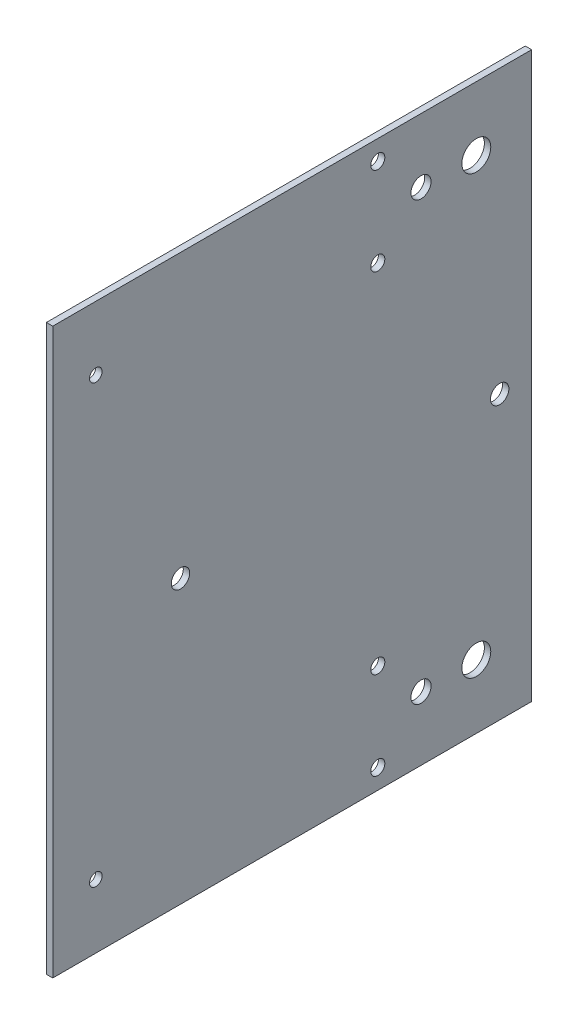
ISO-10303-21;
HEADER;
FILE_DESCRIPTION(('STEP AP214'),'2;1');
FILE_NAME('part.step','',(''),(''),'','','');
FILE_SCHEMA(('AUTOMOTIVE_DESIGN { 1 0 10303 214 1 1 1 1 }'));
ENDSEC;
DATA;
#1=APPLICATION_CONTEXT('core data for automotive mechanical design processes');
#2=APPLICATION_PROTOCOL_DEFINITION('international standard','automotive_design',2000,#1);
#3=PRODUCT_CONTEXT('',#1,'mechanical');
#4=PRODUCT('Part','Part','',(#3));
#5=PRODUCT_RELATED_PRODUCT_CATEGORY('part','',(#4));
#6=PRODUCT_DEFINITION_FORMATION('','',#4);
#7=PRODUCT_DEFINITION_CONTEXT('part definition',#1,'design');
#8=PRODUCT_DEFINITION('design','',#6,#7);
#9=PRODUCT_DEFINITION_SHAPE('','',#8);
#10=(LENGTH_UNIT() NAMED_UNIT(*) SI_UNIT(.MILLI.,.METRE.));
#11=(NAMED_UNIT(*) PLANE_ANGLE_UNIT() SI_UNIT($,.RADIAN.));
#12=(NAMED_UNIT(*) SI_UNIT($,.STERADIAN.) SOLID_ANGLE_UNIT());
#13=UNCERTAINTY_MEASURE_WITH_UNIT(LENGTH_MEASURE(1.E-05),#10,'distance_accuracy_value','');
#14=(GEOMETRIC_REPRESENTATION_CONTEXT(3) GLOBAL_UNCERTAINTY_ASSIGNED_CONTEXT((#13)) GLOBAL_UNIT_ASSIGNED_CONTEXT((#10,
#11,#12)) REPRESENTATION_CONTEXT('',''));
#15=CARTESIAN_POINT('',(0.,0.,0.));
#16=DIRECTION('',(0.,0.,1.));
#17=DIRECTION('',(1.,0.,0.));
#18=AXIS2_PLACEMENT_3D('',#15,#16,#17);
#19=CARTESIAN_POINT('',(0.,83.4547340050886,-95.25));
#20=DIRECTION('',(0.,0.,1.));
#21=DIRECTION('',(0.,-1.,0.));
#22=AXIS2_PLACEMENT_3D('',#19,#20,#21);
#23=PLANE('',#22);
#24=DIRECTION('',(0.,-1.,0.));
#25=VECTOR('',#24,1.);
#26=CARTESIAN_POINT('',(0.,83.4547340050886,-95.25));
#27=LINE('',#26,#25);
#28=CARTESIAN_POINT('',(0.,112.299468010177,-95.25));
#29=VERTEX_POINT('',#28);
#30=CARTESIAN_POINT('',(0.,0.,-95.25));
#31=VERTEX_POINT('',#30);
#32=EDGE_CURVE('E12',#29,#31,#27,.T.);
#33=ORIENTED_EDGE('',*,*,#32,.F.);
#34=DIRECTION('',(-1.,0.,0.));
#35=VECTOR('',#34,1.);
#36=CARTESIAN_POINT('',(0.,112.299468010177,-95.25));
#37=LINE('',#36,#35);
#38=CARTESIAN_POINT('',(1.27,112.299468010177,-95.25));
#39=VERTEX_POINT('',#38);
#40=EDGE_CURVE('E87',#39,#29,#37,.T.);
#41=ORIENTED_EDGE('',*,*,#40,.F.);
#42=DIRECTION('',(0.,1.,0.));
#43=VECTOR('',#42,1.);
#44=CARTESIAN_POINT('',(1.27,83.4547340050886,-95.25));
#45=LINE('',#44,#43);
#46=CARTESIAN_POINT('',(1.27,0.,-95.25));
#47=VERTEX_POINT('',#46);
#48=EDGE_CURVE('E58',#39,#47,#45,.F.);
#49=ORIENTED_EDGE('',*,*,#48,.T.);
#50=DIRECTION('',(-1.,0.,0.));
#51=VECTOR('',#50,1.);
#52=CARTESIAN_POINT('',(0.,0.,-95.25));
#53=LINE('',#52,#51);
#54=EDGE_CURVE('E85',#47,#31,#53,.T.);
#55=ORIENTED_EDGE('',*,*,#54,.T.);
#56=EDGE_LOOP('',(#33,#41,#49,#55));
#57=FACE_BOUND('',#56,.T.);
#58=ADVANCED_FACE('F39',(#57),#23,.F.);
#59=CARTESIAN_POINT('',(0.,83.4547340050886,0.));
#60=DIRECTION('',(0.,0.,1.));
#61=DIRECTION('',(0.,-1.,0.));
#62=AXIS2_PLACEMENT_3D('',#59,#60,#61);
#63=PLANE('',#62);
#64=DIRECTION('',(0.,-1.,0.));
#65=VECTOR('',#64,1.);
#66=CARTESIAN_POINT('',(0.,83.4547340050886,0.));
#67=LINE('',#66,#65);
#68=CARTESIAN_POINT('',(0.,112.299468010177,0.));
#69=VERTEX_POINT('',#68);
#70=CARTESIAN_POINT('',(0.,0.,0.));
#71=VERTEX_POINT('',#70);
#72=EDGE_CURVE('E49',#69,#71,#67,.T.);
#73=ORIENTED_EDGE('',*,*,#72,.T.);
#74=DIRECTION('',(-1.,0.,0.));
#75=VECTOR('',#74,1.);
#76=CARTESIAN_POINT('',(0.,0.,0.));
#77=LINE('',#76,#75);
#78=CARTESIAN_POINT('',(1.27,0.,0.));
#79=VERTEX_POINT('',#78);
#80=EDGE_CURVE('E128',#79,#71,#77,.T.);
#81=ORIENTED_EDGE('',*,*,#80,.F.);
#82=DIRECTION('',(0.,1.,0.));
#83=VECTOR('',#82,1.);
#84=CARTESIAN_POINT('',(1.27,83.4547340050886,0.));
#85=LINE('',#84,#83);
#86=CARTESIAN_POINT('',(1.27,112.299468010177,0.));
#87=VERTEX_POINT('',#86);
#88=EDGE_CURVE('E76',#87,#79,#85,.F.);
#89=ORIENTED_EDGE('',*,*,#88,.F.);
#90=DIRECTION('',(-1.,0.,0.));
#91=VECTOR('',#90,1.);
#92=CARTESIAN_POINT('',(0.,112.299468010177,0.));
#93=LINE('',#92,#91);
#94=EDGE_CURVE('E155',#87,#69,#93,.T.);
#95=ORIENTED_EDGE('',*,*,#94,.T.);
#96=EDGE_LOOP('',(#73,#81,#89,#95));
#97=FACE_BOUND('',#96,.T.);
#98=ADVANCED_FACE('F196',(#97),#63,.T.);
#99=CARTESIAN_POINT('',(0.,56.1497340050886,-25.4));
#100=DIRECTION('',(-1.,0.,0.));
#101=DIRECTION('',(0.,0.,1.));
#102=AXIS2_PLACEMENT_3D('',#99,#100,#101);
#103=CYLINDRICAL_SURFACE('',#102,1.8288);
#104=CARTESIAN_POINT('',(0.,56.1497340050886,-25.4));
#105=DIRECTION('',(-1.,0.,0.));
#106=DIRECTION('',(0.,0.,1.));
#107=AXIS2_PLACEMENT_3D('',#104,#105,#106);
#108=CIRCLE('',#107,1.8288);
#109=CARTESIAN_POINT('',(0.,56.1497340050886,-23.5712));
#110=VERTEX_POINT('',#109);
#111=EDGE_CURVE('E89',#110,#110,#108,.T.);
#112=ORIENTED_EDGE('',*,*,#111,.T.);
#113=EDGE_LOOP('',(#112));
#114=FACE_BOUND('',#113,.T.);
#115=CARTESIAN_POINT('',(1.27,56.1497340050886,-25.4));
#116=DIRECTION('',(-1.,0.,0.));
#117=DIRECTION('',(0.,0.,1.));
#118=AXIS2_PLACEMENT_3D('',#115,#116,#117);
#119=CIRCLE('',#118,1.8288);
#120=CARTESIAN_POINT('',(1.27,56.1497340050886,-23.5712));
#121=VERTEX_POINT('',#120);
#122=EDGE_CURVE('E142',#121,#121,#119,.T.);
#123=ORIENTED_EDGE('',*,*,#122,.F.);
#124=EDGE_LOOP('',(#123));
#125=FACE_BOUND('',#124,.T.);
#126=ADVANCED_FACE('F189',(#114,#125),#103,.F.);
#127=CARTESIAN_POINT('',(0.,56.1497340050886,-88.9));
#128=DIRECTION('',(-1.,0.,0.));
#129=DIRECTION('',(0.,0.,1.));
#130=AXIS2_PLACEMENT_3D('',#127,#128,#129);
#131=CYLINDRICAL_SURFACE('',#130,1.82879999999999);
#132=CARTESIAN_POINT('',(0.,56.1497340050886,-88.9));
#133=DIRECTION('',(-1.,0.,0.));
#134=DIRECTION('',(0.,0.,1.));
#135=AXIS2_PLACEMENT_3D('',#132,#133,#134);
#136=CIRCLE('',#135,1.82879999999999);
#137=CARTESIAN_POINT('',(0.,56.1497340050886,-87.0712));
#138=VERTEX_POINT('',#137);
#139=EDGE_CURVE('E176',#138,#138,#136,.T.);
#140=ORIENTED_EDGE('',*,*,#139,.T.);
#141=EDGE_LOOP('',(#140));
#142=FACE_BOUND('',#141,.T.);
#143=CARTESIAN_POINT('',(1.27,56.1497340050886,-88.9));
#144=DIRECTION('',(-1.,0.,0.));
#145=DIRECTION('',(0.,0.,1.));
#146=AXIS2_PLACEMENT_3D('',#143,#144,#145);
#147=CIRCLE('',#146,1.82879999999999);
#148=CARTESIAN_POINT('',(1.27,56.1497340050886,-87.0712));
#149=VERTEX_POINT('',#148);
#150=EDGE_CURVE('E43',#149,#149,#147,.T.);
#151=ORIENTED_EDGE('',*,*,#150,.F.);
#152=EDGE_LOOP('',(#151));
#153=FACE_BOUND('',#152,.T.);
#154=ADVANCED_FACE('F187',(#142,#153),#131,.F.);
#155=CARTESIAN_POINT('',(0.,0.,0.));
#156=DIRECTION('',(1.,0.,0.));
#157=DIRECTION('',(0.,0.,-1.));
#158=AXIS2_PLACEMENT_3D('',#155,#156,#157);
#159=PLANE('',#158);
#160=ORIENTED_EDGE('',*,*,#111,.F.);
#161=EDGE_LOOP('',(#160));
#162=FACE_BOUND('',#161,.T.);
#163=ORIENTED_EDGE('',*,*,#139,.F.);
#164=EDGE_LOOP('',(#163));
#165=FACE_BOUND('',#164,.T.);
#166=ORIENTED_EDGE('',*,*,#32,.T.);
#167=DIRECTION('',(0.,0.,-1.));
#168=VECTOR('',#167,1.);
#169=CARTESIAN_POINT('',(0.,0.,0.));
#170=LINE('',#169,#168);
#171=EDGE_CURVE('E96',#71,#31,#170,.T.);
#172=ORIENTED_EDGE('',*,*,#171,.F.);
#173=ORIENTED_EDGE('',*,*,#72,.F.);
#174=DIRECTION('',(0.,0.,-1.));
#175=VECTOR('',#174,1.);
#176=CARTESIAN_POINT('',(0.,112.299468010177,0.));
#177=LINE('',#176,#175);
#178=EDGE_CURVE('E157',#69,#29,#177,.T.);
#179=ORIENTED_EDGE('',*,*,#178,.T.);
#180=EDGE_LOOP('',(#166,#172,#173,#179));
#181=FACE_BOUND('',#180,.T.);
#182=CARTESIAN_POINT('',(0.,108.349467984177,-64.649999986));
#183=DIRECTION('',(-1.,0.,0.));
#184=DIRECTION('',(0.,0.,-1.));
#185=AXIS2_PLACEMENT_3D('',#182,#183,#184);
#186=CIRCLE('',#185,1.4);
#187=CARTESIAN_POINT('',(0.,108.349467984177,-66.049999986));
#188=VERTEX_POINT('',#187);
#189=EDGE_CURVE('E160',#188,#188,#186,.T.);
#190=ORIENTED_EDGE('',*,*,#189,.F.);
#191=EDGE_LOOP('',(#190));
#192=FACE_BOUND('',#191,.T.);
#193=CARTESIAN_POINT('',(0.,99.5994680101771,-73.25));
#194=DIRECTION('',(-1.,0.,0.));
#195=DIRECTION('',(0.,0.,-1.));
#196=AXIS2_PLACEMENT_3D('',#193,#194,#195);
#197=CIRCLE('',#196,2.);
#198=CARTESIAN_POINT('',(0.,99.5994680101771,-75.25));
#199=VERTEX_POINT('',#198);
#200=EDGE_CURVE('E163',#199,#199,#197,.T.);
#201=ORIENTED_EDGE('',*,*,#200,.F.);
#202=EDGE_LOOP('',(#201));
#203=FACE_BOUND('',#202,.T.);
#204=CARTESIAN_POINT('',(0.,99.5994680101771,-84.25));
#205=DIRECTION('',(-1.,0.,0.));
#206=DIRECTION('',(0.,0.,-1.));
#207=AXIS2_PLACEMENT_3D('',#204,#205,#206);
#208=CIRCLE('',#207,2.87699996099999);
#209=CARTESIAN_POINT('',(0.,99.5994680101771,-87.126999961));
#210=VERTEX_POINT('',#209);
#211=EDGE_CURVE('E169',#210,#210,#208,.T.);
#212=ORIENTED_EDGE('',*,*,#211,.F.);
#213=EDGE_LOOP('',(#212));
#214=FACE_BOUND('',#213,.T.);
#215=CARTESIAN_POINT('',(0.,90.8494679841771,-64.649999986));
#216=DIRECTION('',(-1.,0.,0.));
#217=DIRECTION('',(0.,0.,-1.));
#218=AXIS2_PLACEMENT_3D('',#215,#216,#217);
#219=CIRCLE('',#218,1.4);
#220=CARTESIAN_POINT('',(0.,90.8494679841771,-66.049999986));
#221=VERTEX_POINT('',#220);
#222=EDGE_CURVE('E104',#221,#221,#219,.T.);
#223=ORIENTED_EDGE('',*,*,#222,.F.);
#224=EDGE_LOOP('',(#223));
#225=FACE_BOUND('',#224,.T.);
#226=CARTESIAN_POINT('',(0.,99.5994680101771,-8.55800000000001));
#227=DIRECTION('',(-1.,0.,0.));
#228=DIRECTION('',(0.,0.,-1.));
#229=AXIS2_PLACEMENT_3D('',#226,#227,#228);
#230=CIRCLE('',#229,1.24968);
#231=CARTESIAN_POINT('',(0.,99.5994680101771,-9.80768000000001));
#232=VERTEX_POINT('',#231);
#233=EDGE_CURVE('E101',#232,#232,#230,.T.);
#234=ORIENTED_EDGE('',*,*,#233,.F.);
#235=EDGE_LOOP('',(#234));
#236=FACE_BOUND('',#235,.T.);
#237=CARTESIAN_POINT('',(0.,3.95000002599999,-64.649999986));
#238=DIRECTION('',(1.,0.,0.));
#239=DIRECTION('',(0.,0.,-1.));
#240=AXIS2_PLACEMENT_3D('',#237,#238,#239);
#241=CIRCLE('',#240,1.4);
#242=CARTESIAN_POINT('',(0.,3.95000002599999,-66.049999986));
#243=VERTEX_POINT('',#242);
#244=EDGE_CURVE('E118',#243,#243,#241,.T.);
#245=ORIENTED_EDGE('',*,*,#244,.T.);
#246=EDGE_LOOP('',(#245));
#247=FACE_BOUND('',#246,.T.);
#248=CARTESIAN_POINT('',(0.,12.7,-73.25));
#249=DIRECTION('',(1.,0.,0.));
#250=DIRECTION('',(0.,0.,-1.));
#251=AXIS2_PLACEMENT_3D('',#248,#249,#250);
#252=CIRCLE('',#251,2.);
#253=CARTESIAN_POINT('',(0.,12.7,-75.25));
#254=VERTEX_POINT('',#253);
#255=EDGE_CURVE('E115',#254,#254,#252,.T.);
#256=ORIENTED_EDGE('',*,*,#255,.T.);
#257=EDGE_LOOP('',(#256));
#258=FACE_BOUND('',#257,.T.);
#259=CARTESIAN_POINT('',(0.,12.7,-84.25));
#260=DIRECTION('',(1.,0.,0.));
#261=DIRECTION('',(0.,0.,-1.));
#262=AXIS2_PLACEMENT_3D('',#259,#260,#261);
#263=CIRCLE('',#262,2.87699996099999);
#264=CARTESIAN_POINT('',(0.,12.7,-87.126999961));
#265=VERTEX_POINT('',#264);
#266=EDGE_CURVE('E112',#265,#265,#263,.T.);
#267=ORIENTED_EDGE('',*,*,#266,.T.);
#268=EDGE_LOOP('',(#267));
#269=FACE_BOUND('',#268,.T.);
#270=CARTESIAN_POINT('',(0.,21.450000026,-64.649999986));
#271=DIRECTION('',(1.,0.,0.));
#272=DIRECTION('',(0.,0.,-1.));
#273=AXIS2_PLACEMENT_3D('',#270,#271,#272);
#274=CIRCLE('',#273,1.4);
#275=CARTESIAN_POINT('',(0.,21.450000026,-66.049999986));
#276=VERTEX_POINT('',#275);
#277=EDGE_CURVE('E109',#276,#276,#274,.T.);
#278=ORIENTED_EDGE('',*,*,#277,.T.);
#279=EDGE_LOOP('',(#278));
#280=FACE_BOUND('',#279,.T.);
#281=CARTESIAN_POINT('',(0.,12.7,-8.55800000000001));
#282=DIRECTION('',(1.,0.,0.));
#283=DIRECTION('',(0.,0.,-1.));
#284=AXIS2_PLACEMENT_3D('',#281,#282,#283);
#285=CIRCLE('',#284,1.24968);
#286=CARTESIAN_POINT('',(0.,12.7,-9.80768000000001));
#287=VERTEX_POINT('',#286);
#288=EDGE_CURVE('E97',#287,#287,#285,.T.);
#289=ORIENTED_EDGE('',*,*,#288,.T.);
#290=EDGE_LOOP('',(#289));
#291=FACE_BOUND('',#290,.T.);
#292=ADVANCED_FACE('F41',(#162,#165,#181,#192,#203,#214,#225,#236,#247,#258,#269,#280,#291),
#159,.F.);
#293=CARTESIAN_POINT('',(1.27,83.4547340050886,-95.25));
#294=DIRECTION('',(1.,0.,0.));
#295=DIRECTION('',(0.,0.,-1.));
#296=AXIS2_PLACEMENT_3D('',#293,#294,#295);
#297=PLANE('',#296);
#298=ORIENTED_EDGE('',*,*,#122,.T.);
#299=EDGE_LOOP('',(#298));
#300=FACE_BOUND('',#299,.T.);
#301=ORIENTED_EDGE('',*,*,#150,.T.);
#302=EDGE_LOOP('',(#301));
#303=FACE_BOUND('',#302,.T.);
#304=ORIENTED_EDGE('',*,*,#48,.F.);
#305=DIRECTION('',(0.,0.,-1.));
#306=VECTOR('',#305,1.);
#307=CARTESIAN_POINT('',(1.27,112.299468010177,0.));
#308=LINE('',#307,#306);
#309=EDGE_CURVE('E167',#87,#39,#308,.T.);
#310=ORIENTED_EDGE('',*,*,#309,.F.);
#311=ORIENTED_EDGE('',*,*,#88,.T.);
#312=DIRECTION('',(0.,0.,-1.));
#313=VECTOR('',#312,1.);
#314=CARTESIAN_POINT('',(1.27,0.,0.));
#315=LINE('',#314,#313);
#316=EDGE_CURVE('E94',#79,#47,#315,.T.);
#317=ORIENTED_EDGE('',*,*,#316,.T.);
#318=EDGE_LOOP('',(#304,#310,#311,#317));
#319=FACE_BOUND('',#318,.T.);
#320=CARTESIAN_POINT('',(1.27,108.349467984177,-64.649999986));
#321=DIRECTION('',(-1.,0.,0.));
#322=DIRECTION('',(0.,0.,-1.));
#323=AXIS2_PLACEMENT_3D('',#320,#321,#322);
#324=CIRCLE('',#323,1.4);
#325=CARTESIAN_POINT('',(1.27,108.349467984177,-66.049999986));
#326=VERTEX_POINT('',#325);
#327=EDGE_CURVE('E152',#326,#326,#324,.T.);
#328=ORIENTED_EDGE('',*,*,#327,.T.);
#329=EDGE_LOOP('',(#328));
#330=FACE_BOUND('',#329,.T.);
#331=CARTESIAN_POINT('',(1.27,99.5994680101771,-73.25));
#332=DIRECTION('',(-1.,0.,0.));
#333=DIRECTION('',(0.,0.,-1.));
#334=AXIS2_PLACEMENT_3D('',#331,#332,#333);
#335=CIRCLE('',#334,2.);
#336=CARTESIAN_POINT('',(1.27,99.5994680101771,-75.25));
#337=VERTEX_POINT('',#336);
#338=EDGE_CURVE('E149',#337,#337,#335,.T.);
#339=ORIENTED_EDGE('',*,*,#338,.T.);
#340=EDGE_LOOP('',(#339));
#341=FACE_BOUND('',#340,.T.);
#342=CARTESIAN_POINT('',(1.27,99.5994680101771,-84.25));
#343=DIRECTION('',(-1.,0.,0.));
#344=DIRECTION('',(0.,0.,-1.));
#345=AXIS2_PLACEMENT_3D('',#342,#343,#344);
#346=CIRCLE('',#345,2.87699996099999);
#347=CARTESIAN_POINT('',(1.27,99.5994680101771,-87.126999961));
#348=VERTEX_POINT('',#347);
#349=EDGE_CURVE('E146',#348,#348,#346,.T.);
#350=ORIENTED_EDGE('',*,*,#349,.T.);
#351=EDGE_LOOP('',(#350));
#352=FACE_BOUND('',#351,.T.);
#353=CARTESIAN_POINT('',(1.27,90.8494679841771,-64.649999986));
#354=DIRECTION('',(-1.,0.,0.));
#355=DIRECTION('',(0.,0.,-1.));
#356=AXIS2_PLACEMENT_3D('',#353,#354,#355);
#357=CIRCLE('',#356,1.4);
#358=CARTESIAN_POINT('',(1.27,90.8494679841771,-66.049999986));
#359=VERTEX_POINT('',#358);
#360=EDGE_CURVE('E143',#359,#359,#357,.T.);
#361=ORIENTED_EDGE('',*,*,#360,.T.);
#362=EDGE_LOOP('',(#361));
#363=FACE_BOUND('',#362,.T.);
#364=CARTESIAN_POINT('',(1.27,99.5994680101771,-8.55800000000001));
#365=DIRECTION('',(-1.,0.,0.));
#366=DIRECTION('',(0.,0.,-1.));
#367=AXIS2_PLACEMENT_3D('',#364,#365,#366);
#368=CIRCLE('',#367,1.24968);
#369=CARTESIAN_POINT('',(1.27,99.5994680101771,-9.80768000000001));
#370=VERTEX_POINT('',#369);
#371=EDGE_CURVE('E139',#370,#370,#368,.T.);
#372=ORIENTED_EDGE('',*,*,#371,.T.);
#373=EDGE_LOOP('',(#372));
#374=FACE_BOUND('',#373,.T.);
#375=CARTESIAN_POINT('',(1.27,3.95000002599999,-64.649999986));
#376=DIRECTION('',(1.,0.,0.));
#377=DIRECTION('',(0.,0.,-1.));
#378=AXIS2_PLACEMENT_3D('',#375,#376,#377);
#379=CIRCLE('',#378,1.4);
#380=CARTESIAN_POINT('',(1.27,3.95000002599999,-66.049999986));
#381=VERTEX_POINT('',#380);
#382=EDGE_CURVE('E121',#381,#381,#379,.T.);
#383=ORIENTED_EDGE('',*,*,#382,.F.);
#384=EDGE_LOOP('',(#383));
#385=FACE_BOUND('',#384,.T.);
#386=CARTESIAN_POINT('',(1.27,12.7,-73.25));
#387=DIRECTION('',(1.,0.,0.));
#388=DIRECTION('',(0.,0.,-1.));
#389=AXIS2_PLACEMENT_3D('',#386,#387,#388);
#390=CIRCLE('',#389,2.);
#391=CARTESIAN_POINT('',(1.27,12.7,-75.25));
#392=VERTEX_POINT('',#391);
#393=EDGE_CURVE('E124',#392,#392,#390,.T.);
#394=ORIENTED_EDGE('',*,*,#393,.F.);
#395=EDGE_LOOP('',(#394));
#396=FACE_BOUND('',#395,.T.);
#397=CARTESIAN_POINT('',(1.27,12.7,-84.25));
#398=DIRECTION('',(1.,0.,0.));
#399=DIRECTION('',(0.,0.,-1.));
#400=AXIS2_PLACEMENT_3D('',#397,#398,#399);
#401=CIRCLE('',#400,2.87699996099999);
#402=CARTESIAN_POINT('',(1.27,12.7,-87.126999961));
#403=VERTEX_POINT('',#402);
#404=EDGE_CURVE('E130',#403,#403,#401,.T.);
#405=ORIENTED_EDGE('',*,*,#404,.F.);
#406=EDGE_LOOP('',(#405));
#407=FACE_BOUND('',#406,.T.);
#408=CARTESIAN_POINT('',(1.27,21.450000026,-64.649999986));
#409=DIRECTION('',(1.,0.,0.));
#410=DIRECTION('',(0.,0.,-1.));
#411=AXIS2_PLACEMENT_3D('',#408,#409,#410);
#412=CIRCLE('',#411,1.4);
#413=CARTESIAN_POINT('',(1.27,21.450000026,-66.049999986));
#414=VERTEX_POINT('',#413);
#415=EDGE_CURVE('E133',#414,#414,#412,.T.);
#416=ORIENTED_EDGE('',*,*,#415,.F.);
#417=EDGE_LOOP('',(#416));
#418=FACE_BOUND('',#417,.T.);
#419=CARTESIAN_POINT('',(1.27,12.7,-8.55800000000001));
#420=DIRECTION('',(1.,0.,0.));
#421=DIRECTION('',(0.,0.,-1.));
#422=AXIS2_PLACEMENT_3D('',#419,#420,#421);
#423=CIRCLE('',#422,1.24968);
#424=CARTESIAN_POINT('',(1.27,12.7,-9.80768000000001));
#425=VERTEX_POINT('',#424);
#426=EDGE_CURVE('E136',#425,#425,#423,.T.);
#427=ORIENTED_EDGE('',*,*,#426,.F.);
#428=EDGE_LOOP('',(#427));
#429=FACE_BOUND('',#428,.T.);
#430=ADVANCED_FACE('F99',(#300,#303,#319,#330,#341,#352,#363,#374,#385,#396,#407,#418,#429),
#297,.T.);
#431=CARTESIAN_POINT('',(0.,99.5994680101771,-8.55800000000001));
#432=DIRECTION('',(-1.,0.,0.));
#433=DIRECTION('',(0.,0.,-1.));
#434=AXIS2_PLACEMENT_3D('',#431,#432,#433);
#435=CYLINDRICAL_SURFACE('',#434,1.24968);
#436=ORIENTED_EDGE('',*,*,#233,.T.);
#437=EDGE_LOOP('',(#436));
#438=FACE_BOUND('',#437,.T.);
#439=ORIENTED_EDGE('',*,*,#371,.F.);
#440=EDGE_LOOP('',(#439));
#441=FACE_BOUND('',#440,.T.);
#442=ADVANCED_FACE('F208',(#438,#441),#435,.F.);
#443=CARTESIAN_POINT('',(0.,90.8494679841771,-64.649999986));
#444=DIRECTION('',(-1.,0.,0.));
#445=DIRECTION('',(0.,0.,-1.));
#446=AXIS2_PLACEMENT_3D('',#443,#444,#445);
#447=CYLINDRICAL_SURFACE('',#446,1.4);
#448=ORIENTED_EDGE('',*,*,#222,.T.);
#449=EDGE_LOOP('',(#448));
#450=FACE_BOUND('',#449,.T.);
#451=ORIENTED_EDGE('',*,*,#360,.F.);
#452=EDGE_LOOP('',(#451));
#453=FACE_BOUND('',#452,.T.);
#454=ADVANCED_FACE('F225',(#450,#453),#447,.F.);
#455=CARTESIAN_POINT('',(0.,99.5994680101771,-84.25));
#456=DIRECTION('',(-1.,0.,0.));
#457=DIRECTION('',(0.,0.,-1.));
#458=AXIS2_PLACEMENT_3D('',#455,#456,#457);
#459=CYLINDRICAL_SURFACE('',#458,2.87699996099999);
#460=ORIENTED_EDGE('',*,*,#211,.T.);
#461=EDGE_LOOP('',(#460));
#462=FACE_BOUND('',#461,.T.);
#463=ORIENTED_EDGE('',*,*,#349,.F.);
#464=EDGE_LOOP('',(#463));
#465=FACE_BOUND('',#464,.T.);
#466=ADVANCED_FACE('F221',(#462,#465),#459,.F.);
#467=CARTESIAN_POINT('',(0.,112.299468010177,0.));
#468=DIRECTION('',(0.,1.,0.));
#469=DIRECTION('',(0.,0.,-1.));
#470=AXIS2_PLACEMENT_3D('',#467,#468,#469);
#471=PLANE('',#470);
#472=ORIENTED_EDGE('',*,*,#94,.F.);
#473=ORIENTED_EDGE('',*,*,#309,.T.);
#474=ORIENTED_EDGE('',*,*,#40,.T.);
#475=ORIENTED_EDGE('',*,*,#178,.F.);
#476=EDGE_LOOP('',(#472,#473,#474,#475));
#477=FACE_BOUND('',#476,.T.);
#478=ADVANCED_FACE('F217',(#477),#471,.T.);
#479=CARTESIAN_POINT('',(0.,99.5994680101771,-73.25));
#480=DIRECTION('',(-1.,0.,0.));
#481=DIRECTION('',(0.,0.,-1.));
#482=AXIS2_PLACEMENT_3D('',#479,#480,#481);
#483=CYLINDRICAL_SURFACE('',#482,2.);
#484=ORIENTED_EDGE('',*,*,#200,.T.);
#485=EDGE_LOOP('',(#484));
#486=FACE_BOUND('',#485,.T.);
#487=ORIENTED_EDGE('',*,*,#338,.F.);
#488=EDGE_LOOP('',(#487));
#489=FACE_BOUND('',#488,.T.);
#490=ADVANCED_FACE('F213',(#486,#489),#483,.F.);
#491=CARTESIAN_POINT('',(0.,108.349467984177,-64.649999986));
#492=DIRECTION('',(-1.,0.,0.));
#493=DIRECTION('',(0.,0.,-1.));
#494=AXIS2_PLACEMENT_3D('',#491,#492,#493);
#495=CYLINDRICAL_SURFACE('',#494,1.4);
#496=ORIENTED_EDGE('',*,*,#189,.T.);
#497=EDGE_LOOP('',(#496));
#498=FACE_BOUND('',#497,.T.);
#499=ORIENTED_EDGE('',*,*,#327,.F.);
#500=EDGE_LOOP('',(#499));
#501=FACE_BOUND('',#500,.T.);
#502=ADVANCED_FACE('F209',(#498,#501),#495,.F.);
#503=CARTESIAN_POINT('',(0.,12.7,-8.55800000000001));
#504=DIRECTION('',(1.,0.,0.));
#505=DIRECTION('',(0.,0.,-1.));
#506=AXIS2_PLACEMENT_3D('',#503,#504,#505);
#507=CYLINDRICAL_SURFACE('',#506,1.24968);
#508=ORIENTED_EDGE('',*,*,#288,.F.);
#509=EDGE_LOOP('',(#508));
#510=FACE_BOUND('',#509,.T.);
#511=ORIENTED_EDGE('',*,*,#426,.T.);
#512=EDGE_LOOP('',(#511));
#513=FACE_BOUND('',#512,.T.);
#514=ADVANCED_FACE('F212',(#510,#513),#507,.F.);
#515=CARTESIAN_POINT('',(0.,21.450000026,-64.649999986));
#516=DIRECTION('',(1.,0.,0.));
#517=DIRECTION('',(0.,0.,-1.));
#518=AXIS2_PLACEMENT_3D('',#515,#516,#517);
#519=CYLINDRICAL_SURFACE('',#518,1.4);
#520=ORIENTED_EDGE('',*,*,#277,.F.);
#521=EDGE_LOOP('',(#520));
#522=FACE_BOUND('',#521,.T.);
#523=ORIENTED_EDGE('',*,*,#415,.T.);
#524=EDGE_LOOP('',(#523));
#525=FACE_BOUND('',#524,.T.);
#526=ADVANCED_FACE('F246',(#522,#525),#519,.F.);
#527=CARTESIAN_POINT('',(0.,12.7,-84.25));
#528=DIRECTION('',(1.,0.,0.));
#529=DIRECTION('',(0.,0.,-1.));
#530=AXIS2_PLACEMENT_3D('',#527,#528,#529);
#531=CYLINDRICAL_SURFACE('',#530,2.87699996099999);
#532=ORIENTED_EDGE('',*,*,#266,.F.);
#533=EDGE_LOOP('',(#532));
#534=FACE_BOUND('',#533,.T.);
#535=ORIENTED_EDGE('',*,*,#404,.T.);
#536=EDGE_LOOP('',(#535));
#537=FACE_BOUND('',#536,.T.);
#538=ADVANCED_FACE('F243',(#534,#537),#531,.F.);
#539=CARTESIAN_POINT('',(0.,0.,0.));
#540=DIRECTION('',(0.,-1.,0.));
#541=DIRECTION('',(0.,0.,-1.));
#542=AXIS2_PLACEMENT_3D('',#539,#540,#541);
#543=PLANE('',#542);
#544=ORIENTED_EDGE('',*,*,#54,.F.);
#545=ORIENTED_EDGE('',*,*,#316,.F.);
#546=ORIENTED_EDGE('',*,*,#80,.T.);
#547=ORIENTED_EDGE('',*,*,#171,.T.);
#548=EDGE_LOOP('',(#544,#545,#546,#547));
#549=FACE_BOUND('',#548,.T.);
#550=ADVANCED_FACE('F93',(#549),#543,.T.);
#551=CARTESIAN_POINT('',(0.,12.7,-73.25));
#552=DIRECTION('',(1.,0.,0.));
#553=DIRECTION('',(0.,0.,-1.));
#554=AXIS2_PLACEMENT_3D('',#551,#552,#553);
#555=CYLINDRICAL_SURFACE('',#554,2.);
#556=ORIENTED_EDGE('',*,*,#255,.F.);
#557=EDGE_LOOP('',(#556));
#558=FACE_BOUND('',#557,.T.);
#559=ORIENTED_EDGE('',*,*,#393,.T.);
#560=EDGE_LOOP('',(#559));
#561=FACE_BOUND('',#560,.T.);
#562=ADVANCED_FACE('F236',(#558,#561),#555,.F.);
#563=CARTESIAN_POINT('',(0.,3.95000002599999,-64.649999986));
#564=DIRECTION('',(1.,0.,0.));
#565=DIRECTION('',(0.,0.,-1.));
#566=AXIS2_PLACEMENT_3D('',#563,#564,#565);
#567=CYLINDRICAL_SURFACE('',#566,1.4);
#568=ORIENTED_EDGE('',*,*,#244,.F.);
#569=EDGE_LOOP('',(#568));
#570=FACE_BOUND('',#569,.T.);
#571=ORIENTED_EDGE('',*,*,#382,.T.);
#572=EDGE_LOOP('',(#571));
#573=FACE_BOUND('',#572,.T.);
#574=ADVANCED_FACE('F233',(#570,#573),#567,.F.);
#575=CLOSED_SHELL('',(#58,#98,#126,#154,#292,#430,#442,#454,#466,#478,#490,#502,#514,#526,#538,
#550,#562,#574));
#576=MANIFOLD_SOLID_BREP('B2',#575);
#577=ADVANCED_BREP_SHAPE_REPRESENTATION('',(#18,#576),#14);
#578=SHAPE_DEFINITION_REPRESENTATION(#9,#577);
ENDSEC;
END-ISO-10303-21;
